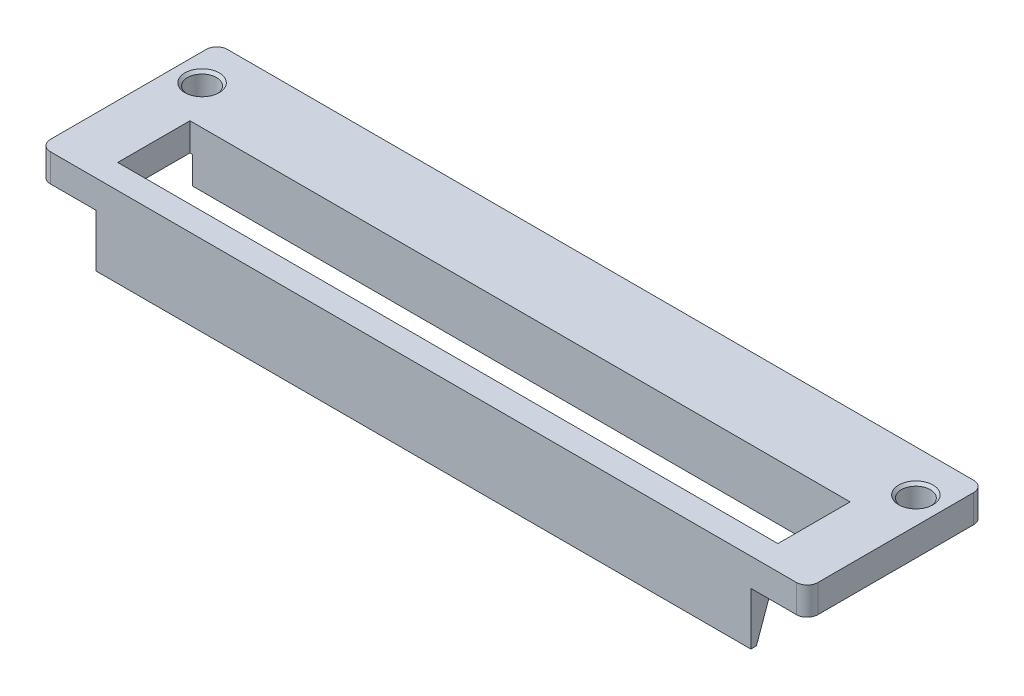
ISO-10303-21;
HEADER;
FILE_DESCRIPTION(('STEP AP214'),'2;1');
FILE_NAME('part.step','',(''),(''),'','','');
FILE_SCHEMA(('AUTOMOTIVE_DESIGN { 1 0 10303 214 1 1 1 1 }'));
ENDSEC;
DATA;
#1=APPLICATION_CONTEXT('core data for automotive mechanical design processes');
#2=APPLICATION_PROTOCOL_DEFINITION('international standard','automotive_design',2000,#1);
#3=PRODUCT_CONTEXT('',#1,'mechanical');
#4=PRODUCT('Part','Part','',(#3));
#5=PRODUCT_RELATED_PRODUCT_CATEGORY('part','',(#4));
#6=PRODUCT_DEFINITION_FORMATION('','',#4);
#7=PRODUCT_DEFINITION_CONTEXT('part definition',#1,'design');
#8=PRODUCT_DEFINITION('design','',#6,#7);
#9=PRODUCT_DEFINITION_SHAPE('','',#8);
#10=(LENGTH_UNIT() NAMED_UNIT(*) SI_UNIT(.MILLI.,.METRE.));
#11=(NAMED_UNIT(*) PLANE_ANGLE_UNIT() SI_UNIT($,.RADIAN.));
#12=(NAMED_UNIT(*) SI_UNIT($,.STERADIAN.) SOLID_ANGLE_UNIT());
#13=UNCERTAINTY_MEASURE_WITH_UNIT(LENGTH_MEASURE(1.E-05),#10,'distance_accuracy_value','');
#14=(GEOMETRIC_REPRESENTATION_CONTEXT(3) GLOBAL_UNCERTAINTY_ASSIGNED_CONTEXT((#13)) GLOBAL_UNIT_ASSIGNED_CONTEXT((#10,
#11,#12)) REPRESENTATION_CONTEXT('',''));
#15=CARTESIAN_POINT('',(0.,0.,0.));
#16=DIRECTION('',(0.,0.,1.));
#17=DIRECTION('',(1.,0.,0.));
#18=AXIS2_PLACEMENT_3D('',#15,#16,#17);
#19=CARTESIAN_POINT('',(0.,-2.6,0.));
#20=DIRECTION('',(0.,1.,0.));
#21=DIRECTION('',(0.,0.,1.));
#22=AXIS2_PLACEMENT_3D('',#19,#20,#21);
#23=PLANE('',#22);
#24=DIRECTION('',(1.,0.,0.));
#25=VECTOR('',#24,1.);
#26=CARTESIAN_POINT('',(0.,-2.6,16.5));
#27=LINE('',#26,#25);
#28=CARTESIAN_POINT('',(1.,-2.6,16.5));
#29=VERTEX_POINT('',#28);
#30=CARTESIAN_POINT('',(5.25,-2.6,16.5));
#31=VERTEX_POINT('',#30);
#32=EDGE_CURVE('E290',#29,#31,#27,.T.);
#33=ORIENTED_EDGE('',*,*,#32,.F.);
#34=CARTESIAN_POINT('',(1.,-2.6,15.5));
#35=DIRECTION('',(0.,1.,0.));
#36=DIRECTION('',(0.,0.,1.));
#37=AXIS2_PLACEMENT_3D('',#34,#35,#36);
#38=CIRCLE('',#37,1.);
#39=CARTESIAN_POINT('',(0.,-2.6,15.5));
#40=VERTEX_POINT('',#39);
#41=EDGE_CURVE('E58',#29,#40,#38,.F.);
#42=ORIENTED_EDGE('',*,*,#41,.T.);
#43=DIRECTION('',(0.,0.,1.));
#44=VECTOR('',#43,1.);
#45=CARTESIAN_POINT('',(0.,-2.6,7.5));
#46=LINE('',#45,#44);
#47=CARTESIAN_POINT('',(0.,-2.6,1.));
#48=VERTEX_POINT('',#47);
#49=EDGE_CURVE('E286',#48,#40,#46,.T.);
#50=ORIENTED_EDGE('',*,*,#49,.F.);
#51=CARTESIAN_POINT('',(1.,-2.6,1.));
#52=DIRECTION('',(0.,1.,0.));
#53=DIRECTION('',(0.,0.,1.));
#54=AXIS2_PLACEMENT_3D('',#51,#52,#53);
#55=CIRCLE('',#54,1.);
#56=CARTESIAN_POINT('',(1.,-2.6,0.));
#57=VERTEX_POINT('',#56);
#58=EDGE_CURVE('E199',#48,#57,#55,.F.);
#59=ORIENTED_EDGE('',*,*,#58,.T.);
#60=DIRECTION('',(1.,0.,0.));
#61=VECTOR('',#60,1.);
#62=CARTESIAN_POINT('',(0.,-2.6,0.));
#63=LINE('',#62,#61);
#64=CARTESIAN_POINT('',(5.25,-2.6,0.));
#65=VERTEX_POINT('',#64);
#66=EDGE_CURVE('E193',#57,#65,#63,.T.);
#67=ORIENTED_EDGE('',*,*,#66,.T.);
#68=DIRECTION('',(0.,0.,-1.));
#69=VECTOR('',#68,1.);
#70=CARTESIAN_POINT('',(5.25,-2.6,16.5));
#71=LINE('',#70,#69);
#72=CARTESIAN_POINT('',(5.25,-2.6,7.5));
#73=VERTEX_POINT('',#72);
#74=EDGE_CURVE('E196',#73,#65,#71,.T.);
#75=ORIENTED_EDGE('',*,*,#74,.F.);
#76=DIRECTION('',(1.,0.,0.));
#77=VECTOR('',#76,1.);
#78=CARTESIAN_POINT('',(71.5,-2.6,7.5));
#79=LINE('',#78,#77);
#80=CARTESIAN_POINT('',(5.,-2.6,7.5));
#81=VERTEX_POINT('',#80);
#82=EDGE_CURVE('E222',#81,#73,#79,.T.);
#83=ORIENTED_EDGE('',*,*,#82,.F.);
#84=DIRECTION('',(0.,0.,-1.));
#85=VECTOR('',#84,1.);
#86=CARTESIAN_POINT('',(5.,-2.6,14.23));
#87=LINE('',#86,#85);
#88=CARTESIAN_POINT('',(5.,-2.6,14.23));
#89=VERTEX_POINT('',#88);
#90=EDGE_CURVE('E302',#89,#81,#87,.T.);
#91=ORIENTED_EDGE('',*,*,#90,.F.);
#92=DIRECTION('',(-1.,0.,0.));
#93=VECTOR('',#92,1.);
#94=CARTESIAN_POINT('',(66.5,-2.6,14.23));
#95=LINE('',#94,#93);
#96=CARTESIAN_POINT('',(5.25,-2.6,14.23));
#97=VERTEX_POINT('',#96);
#98=EDGE_CURVE('E298',#97,#89,#95,.T.);
#99=ORIENTED_EDGE('',*,*,#98,.F.);
#100=DIRECTION('',(0.,0.,-1.));
#101=VECTOR('',#100,1.);
#102=CARTESIAN_POINT('',(5.25,-2.6,14.23));
#103=LINE('',#102,#101);
#104=EDGE_CURVE('E258',#31,#97,#103,.T.);
#105=ORIENTED_EDGE('',*,*,#104,.F.);
#106=EDGE_LOOP('',(#33,#42,#50,#59,#67,#75,#83,#91,#99,#105));
#107=FACE_BOUND('',#106,.T.);
#108=CARTESIAN_POINT('',(2.5,-2.6,3.875));
#109=DIRECTION('',(0.,1.,0.));
#110=DIRECTION('',(0.,0.,1.));
#111=AXIS2_PLACEMENT_3D('',#108,#109,#110);
#112=CIRCLE('',#111,1.35);
#113=CARTESIAN_POINT('',(2.5,-2.6,5.225));
#114=VERTEX_POINT('',#113);
#115=EDGE_CURVE('E234',#114,#114,#112,.F.);
#116=ORIENTED_EDGE('',*,*,#115,.F.);
#117=EDGE_LOOP('',(#116));
#118=FACE_BOUND('',#117,.T.);
#119=ADVANCED_FACE('F42',(#107,#118),#23,.F.);
#120=CARTESIAN_POINT('',(71.5,-5.81,0.));
#121=DIRECTION('',(0.,0.,1.));
#122=DIRECTION('',(1.,0.,0.));
#123=AXIS2_PLACEMENT_3D('',#120,#121,#122);
#124=PLANE('',#123);
#125=DIRECTION('',(-1.,0.,0.));
#126=VECTOR('',#125,1.);
#127=CARTESIAN_POINT('',(71.5,0.,0.));
#128=LINE('',#127,#126);
#129=CARTESIAN_POINT('',(70.5,0.,0.));
#130=VERTEX_POINT('',#129);
#131=CARTESIAN_POINT('',(1.,0.,0.));
#132=VERTEX_POINT('',#131);
#133=EDGE_CURVE('E343',#130,#132,#128,.T.);
#134=ORIENTED_EDGE('',*,*,#133,.F.);
#135=DIRECTION('',(0.,1.,0.));
#136=VECTOR('',#135,1.);
#137=CARTESIAN_POINT('',(70.5,-2.6,0.));
#138=LINE('',#137,#136);
#139=CARTESIAN_POINT('',(70.5,-2.6,0.));
#140=VERTEX_POINT('',#139);
#141=EDGE_CURVE('E361',#130,#140,#138,.F.);
#142=ORIENTED_EDGE('',*,*,#141,.T.);
#143=DIRECTION('',(1.,0.,0.));
#144=VECTOR('',#143,1.);
#145=CARTESIAN_POINT('',(71.5,-2.6,0.));
#146=LINE('',#145,#144);
#147=CARTESIAN_POINT('',(66.25,-2.6,0.));
#148=VERTEX_POINT('',#147);
#149=EDGE_CURVE('E227',#148,#140,#146,.T.);
#150=ORIENTED_EDGE('',*,*,#149,.F.);
#151=DIRECTION('',(0.,1.,0.));
#152=VECTOR('',#151,1.);
#153=CARTESIAN_POINT('',(66.25,-2.6,0.));
#154=LINE('',#153,#152);
#155=CARTESIAN_POINT('',(66.25,-5.81,0.));
#156=VERTEX_POINT('',#155);
#157=EDGE_CURVE('E224',#156,#148,#154,.T.);
#158=ORIENTED_EDGE('',*,*,#157,.F.);
#159=DIRECTION('',(-1.,0.,0.));
#160=VECTOR('',#159,1.);
#161=CARTESIAN_POINT('',(71.5,-5.81,0.));
#162=LINE('',#161,#160);
#163=CARTESIAN_POINT('',(5.25,-5.81,0.));
#164=VERTEX_POINT('',#163);
#165=EDGE_CURVE('E219',#156,#164,#162,.T.);
#166=ORIENTED_EDGE('',*,*,#165,.T.);
#167=DIRECTION('',(0.,-1.,0.));
#168=VECTOR('',#167,1.);
#169=CARTESIAN_POINT('',(5.25,-2.6,0.));
#170=LINE('',#169,#168);
#171=EDGE_CURVE('E204',#65,#164,#170,.T.);
#172=ORIENTED_EDGE('',*,*,#171,.F.);
#173=ORIENTED_EDGE('',*,*,#66,.F.);
#174=DIRECTION('',(0.,1.,0.));
#175=VECTOR('',#174,1.);
#176=CARTESIAN_POINT('',(1.,-5.81,0.));
#177=LINE('',#176,#175);
#178=EDGE_CURVE('E359',#57,#132,#177,.T.);
#179=ORIENTED_EDGE('',*,*,#178,.T.);
#180=EDGE_LOOP('',(#134,#142,#150,#158,#166,#172,#173,#179));
#181=FACE_BOUND('',#180,.T.);
#182=ADVANCED_FACE('F216',(#181),#124,.F.);
#183=CARTESIAN_POINT('',(71.5,0.,0.));
#184=DIRECTION('',(0.,-1.,0.));
#185=DIRECTION('',(0.,0.,-1.));
#186=AXIS2_PLACEMENT_3D('',#183,#184,#185);
#187=PLANE('',#186);
#188=CARTESIAN_POINT('',(2.5,0.,3.875));
#189=DIRECTION('',(0.,-1.,0.));
#190=DIRECTION('',(0.,0.,-1.));
#191=AXIS2_PLACEMENT_3D('',#188,#189,#190);
#192=CIRCLE('',#191,1.6);
#193=CARTESIAN_POINT('',(2.5,0.,2.275));
#194=VERTEX_POINT('',#193);
#195=EDGE_CURVE('E51',#194,#194,#192,.T.);
#196=ORIENTED_EDGE('',*,*,#195,.T.);
#197=EDGE_LOOP('',(#196));
#198=FACE_BOUND('',#197,.T.);
#199=CARTESIAN_POINT('',(69.,0.,3.875));
#200=DIRECTION('',(0.,-1.,0.));
#201=DIRECTION('',(0.,0.,-1.));
#202=AXIS2_PLACEMENT_3D('',#199,#200,#201);
#203=CIRCLE('',#202,1.60000000000002);
#204=CARTESIAN_POINT('',(69.,0.,2.27499999999998));
#205=VERTEX_POINT('',#204);
#206=EDGE_CURVE('E381',#205,#205,#203,.T.);
#207=ORIENTED_EDGE('',*,*,#206,.T.);
#208=EDGE_LOOP('',(#207));
#209=FACE_BOUND('',#208,.T.);
#210=DIRECTION('',(0.,0.,1.));
#211=VECTOR('',#210,1.);
#212=CARTESIAN_POINT('',(71.5,0.,0.));
#213=LINE('',#212,#211);
#214=CARTESIAN_POINT('',(71.5,0.,1.));
#215=VERTEX_POINT('',#214);
#216=CARTESIAN_POINT('',(71.5,0.,15.5));
#217=VERTEX_POINT('',#216);
#218=EDGE_CURVE('E326',#215,#217,#213,.T.);
#219=ORIENTED_EDGE('',*,*,#218,.F.);
#220=CARTESIAN_POINT('',(70.5,0.,1.));
#221=DIRECTION('',(0.,-1.,0.));
#222=DIRECTION('',(0.,0.,-1.));
#223=AXIS2_PLACEMENT_3D('',#220,#221,#222);
#224=CIRCLE('',#223,1.);
#225=EDGE_CURVE('E357',#215,#130,#224,.F.);
#226=ORIENTED_EDGE('',*,*,#225,.T.);
#227=ORIENTED_EDGE('',*,*,#133,.T.);
#228=CARTESIAN_POINT('',(1.,0.,1.));
#229=DIRECTION('',(0.,-1.,0.));
#230=DIRECTION('',(0.,0.,-1.));
#231=AXIS2_PLACEMENT_3D('',#228,#229,#230);
#232=CIRCLE('',#231,1.);
#233=CARTESIAN_POINT('',(0.,0.,1.));
#234=VERTEX_POINT('',#233);
#235=EDGE_CURVE('E351',#132,#234,#232,.F.);
#236=ORIENTED_EDGE('',*,*,#235,.T.);
#237=DIRECTION('',(0.,0.,1.));
#238=VECTOR('',#237,1.);
#239=CARTESIAN_POINT('',(0.,0.,0.));
#240=LINE('',#239,#238);
#241=CARTESIAN_POINT('',(0.,0.,15.5));
#242=VERTEX_POINT('',#241);
#243=EDGE_CURVE('E319',#234,#242,#240,.T.);
#244=ORIENTED_EDGE('',*,*,#243,.T.);
#245=CARTESIAN_POINT('',(1.,0.,15.5));
#246=DIRECTION('',(0.,-1.,0.));
#247=DIRECTION('',(0.,0.,-1.));
#248=AXIS2_PLACEMENT_3D('',#245,#246,#247);
#249=CIRCLE('',#248,1.);
#250=CARTESIAN_POINT('',(1.,0.,16.5));
#251=VERTEX_POINT('',#250);
#252=EDGE_CURVE('E353',#242,#251,#249,.F.);
#253=ORIENTED_EDGE('',*,*,#252,.T.);
#254=DIRECTION('',(1.,0.,0.));
#255=VECTOR('',#254,1.);
#256=CARTESIAN_POINT('',(0.,0.,16.5));
#257=LINE('',#256,#255);
#258=CARTESIAN_POINT('',(70.5,0.,16.5));
#259=VERTEX_POINT('',#258);
#260=EDGE_CURVE('E281',#251,#259,#257,.T.);
#261=ORIENTED_EDGE('',*,*,#260,.T.);
#262=CARTESIAN_POINT('',(70.5,0.,15.5));
#263=DIRECTION('',(0.,-1.,0.));
#264=DIRECTION('',(0.,0.,-1.));
#265=AXIS2_PLACEMENT_3D('',#262,#263,#264);
#266=CIRCLE('',#265,1.);
#267=EDGE_CURVE('E355',#259,#217,#266,.F.);
#268=ORIENTED_EDGE('',*,*,#267,.T.);
#269=EDGE_LOOP('',(#219,#226,#227,#236,#244,#253,#261,#268));
#270=FACE_BOUND('',#269,.T.);
#271=DIRECTION('',(0.,0.,-1.));
#272=VECTOR('',#271,1.);
#273=CARTESIAN_POINT('',(5.,0.,14.23));
#274=LINE('',#273,#272);
#275=CARTESIAN_POINT('',(5.,0.,14.23));
#276=VERTEX_POINT('',#275);
#277=CARTESIAN_POINT('',(5.,0.,7.5));
#278=VERTEX_POINT('',#277);
#279=EDGE_CURVE('E289',#276,#278,#274,.T.);
#280=ORIENTED_EDGE('',*,*,#279,.T.);
#281=DIRECTION('',(-1.,0.,0.));
#282=VECTOR('',#281,1.);
#283=CARTESIAN_POINT('',(71.5,0.,7.5));
#284=LINE('',#283,#282);
#285=CARTESIAN_POINT('',(66.5,0.,7.5));
#286=VERTEX_POINT('',#285);
#287=EDGE_CURVE('E341',#286,#278,#284,.T.);
#288=ORIENTED_EDGE('',*,*,#287,.F.);
#289=DIRECTION('',(0.,0.,1.));
#290=VECTOR('',#289,1.);
#291=CARTESIAN_POINT('',(66.5,0.,7.5));
#292=LINE('',#291,#290);
#293=CARTESIAN_POINT('',(66.5,0.,14.23));
#294=VERTEX_POINT('',#293);
#295=EDGE_CURVE('E308',#286,#294,#292,.T.);
#296=ORIENTED_EDGE('',*,*,#295,.T.);
#297=DIRECTION('',(-1.,0.,0.));
#298=VECTOR('',#297,1.);
#299=CARTESIAN_POINT('',(66.5,0.,14.23));
#300=LINE('',#299,#298);
#301=EDGE_CURVE('E311',#294,#276,#300,.T.);
#302=ORIENTED_EDGE('',*,*,#301,.T.);
#303=EDGE_LOOP('',(#280,#288,#296,#302));
#304=FACE_BOUND('',#303,.T.);
#305=ADVANCED_FACE('F386',(#198,#209,#270,#304),#187,.F.);
#306=CARTESIAN_POINT('',(71.5,0.,7.5));
#307=DIRECTION('',(0.,0.,-1.));
#308=DIRECTION('',(0.,1.,0.));
#309=AXIS2_PLACEMENT_3D('',#306,#307,#308);
#310=PLANE('',#309);
#311=ORIENTED_EDGE('',*,*,#82,.T.);
#312=DIRECTION('',(0.,-1.,0.));
#313=VECTOR('',#312,1.);
#314=CARTESIAN_POINT('',(5.25,0.,7.5));
#315=LINE('',#314,#313);
#316=CARTESIAN_POINT('',(5.25,-5.15,7.5));
#317=VERTEX_POINT('',#316);
#318=EDGE_CURVE('E211',#73,#317,#315,.T.);
#319=ORIENTED_EDGE('',*,*,#318,.T.);
#320=DIRECTION('',(-1.,0.,0.));
#321=VECTOR('',#320,1.);
#322=CARTESIAN_POINT('',(71.5,-5.15,7.5));
#323=LINE('',#322,#321);
#324=CARTESIAN_POINT('',(66.25,-5.15,7.5));
#325=VERTEX_POINT('',#324);
#326=EDGE_CURVE('E338',#325,#317,#323,.T.);
#327=ORIENTED_EDGE('',*,*,#326,.F.);
#328=DIRECTION('',(0.,1.,0.));
#329=VECTOR('',#328,1.);
#330=CARTESIAN_POINT('',(66.25,0.,7.5));
#331=LINE('',#330,#329);
#332=CARTESIAN_POINT('',(66.25,-2.6,7.5));
#333=VERTEX_POINT('',#332);
#334=EDGE_CURVE('E248',#325,#333,#331,.T.);
#335=ORIENTED_EDGE('',*,*,#334,.T.);
#336=DIRECTION('',(1.,0.,0.));
#337=VECTOR('',#336,1.);
#338=CARTESIAN_POINT('',(71.5,-2.6,7.5));
#339=LINE('',#338,#337);
#340=CARTESIAN_POINT('',(66.5,-2.6,7.5));
#341=VERTEX_POINT('',#340);
#342=EDGE_CURVE('E238',#333,#341,#339,.T.);
#343=ORIENTED_EDGE('',*,*,#342,.T.);
#344=DIRECTION('',(0.,1.,0.));
#345=VECTOR('',#344,1.);
#346=CARTESIAN_POINT('',(66.5,-2.6,7.5));
#347=LINE('',#346,#345);
#348=EDGE_CURVE('E305',#341,#286,#347,.T.);
#349=ORIENTED_EDGE('',*,*,#348,.T.);
#350=ORIENTED_EDGE('',*,*,#287,.T.);
#351=DIRECTION('',(0.,1.,0.));
#352=VECTOR('',#351,1.);
#353=CARTESIAN_POINT('',(5.,-2.6,7.5));
#354=LINE('',#353,#352);
#355=EDGE_CURVE('E316',#81,#278,#354,.T.);
#356=ORIENTED_EDGE('',*,*,#355,.F.);
#357=EDGE_LOOP('',(#311,#319,#327,#335,#343,#349,#350,#356));
#358=FACE_BOUND('',#357,.T.);
#359=ADVANCED_FACE('F454',(#358),#310,.F.);
#360=CARTESIAN_POINT('',(71.5,-5.15,7.5));
#361=DIRECTION('',(0.,1.,0.));
#362=DIRECTION('',(0.,0.,1.));
#363=AXIS2_PLACEMENT_3D('',#360,#361,#362);
#364=PLANE('',#363);
#365=ORIENTED_EDGE('',*,*,#326,.T.);
#366=DIRECTION('',(0.,0.,-1.));
#367=VECTOR('',#366,1.);
#368=CARTESIAN_POINT('',(5.25,-5.15,7.5));
#369=LINE('',#368,#367);
#370=CARTESIAN_POINT('',(5.25,-5.15,6.25));
#371=VERTEX_POINT('',#370);
#372=EDGE_CURVE('E254',#317,#371,#369,.T.);
#373=ORIENTED_EDGE('',*,*,#372,.T.);
#374=DIRECTION('',(-1.,0.,0.));
#375=VECTOR('',#374,1.);
#376=CARTESIAN_POINT('',(71.5,-5.15,6.25));
#377=LINE('',#376,#375);
#378=CARTESIAN_POINT('',(66.25,-5.15,6.25));
#379=VERTEX_POINT('',#378);
#380=EDGE_CURVE('E335',#379,#371,#377,.T.);
#381=ORIENTED_EDGE('',*,*,#380,.F.);
#382=DIRECTION('',(0.,0.,1.));
#383=VECTOR('',#382,1.);
#384=CARTESIAN_POINT('',(66.25,-5.15,7.5));
#385=LINE('',#384,#383);
#386=EDGE_CURVE('E245',#379,#325,#385,.T.);
#387=ORIENTED_EDGE('',*,*,#386,.T.);
#388=EDGE_LOOP('',(#365,#373,#381,#387));
#389=FACE_BOUND('',#388,.T.);
#390=ADVANCED_FACE('F450',(#389),#364,.F.);
#391=CARTESIAN_POINT('',(71.5,-5.15,6.25));
#392=DIRECTION('',(0.,0.,-1.));
#393=DIRECTION('',(-1.,0.,0.));
#394=AXIS2_PLACEMENT_3D('',#391,#392,#393);
#395=PLANE('',#394);
#396=ORIENTED_EDGE('',*,*,#380,.T.);
#397=DIRECTION('',(0.,-1.,0.));
#398=VECTOR('',#397,1.);
#399=CARTESIAN_POINT('',(5.25,-5.15,6.25));
#400=LINE('',#399,#398);
#401=CARTESIAN_POINT('',(5.25,-5.81,6.25));
#402=VERTEX_POINT('',#401);
#403=EDGE_CURVE('E251',#371,#402,#400,.T.);
#404=ORIENTED_EDGE('',*,*,#403,.T.);
#405=DIRECTION('',(-1.,0.,0.));
#406=VECTOR('',#405,1.);
#407=CARTESIAN_POINT('',(71.5,-5.81,6.25));
#408=LINE('',#407,#406);
#409=CARTESIAN_POINT('',(66.25,-5.81,6.25));
#410=VERTEX_POINT('',#409);
#411=EDGE_CURVE('E332',#410,#402,#408,.T.);
#412=ORIENTED_EDGE('',*,*,#411,.F.);
#413=DIRECTION('',(0.,1.,0.));
#414=VECTOR('',#413,1.);
#415=CARTESIAN_POINT('',(66.25,-5.15,6.25));
#416=LINE('',#415,#414);
#417=EDGE_CURVE('E240',#410,#379,#416,.T.);
#418=ORIENTED_EDGE('',*,*,#417,.T.);
#419=EDGE_LOOP('',(#396,#404,#412,#418));
#420=FACE_BOUND('',#419,.T.);
#421=ADVANCED_FACE('F446',(#420),#395,.F.);
#422=CARTESIAN_POINT('',(71.5,-5.81,6.25));
#423=DIRECTION('',(0.,1.,0.));
#424=DIRECTION('',(0.,0.,1.));
#425=AXIS2_PLACEMENT_3D('',#422,#423,#424);
#426=PLANE('',#425);
#427=ORIENTED_EDGE('',*,*,#411,.T.);
#428=DIRECTION('',(0.,0.,-1.));
#429=VECTOR('',#428,1.);
#430=CARTESIAN_POINT('',(5.25,-5.81,16.5));
#431=LINE('',#430,#429);
#432=EDGE_CURVE('E212',#402,#164,#431,.T.);
#433=ORIENTED_EDGE('',*,*,#432,.T.);
#434=ORIENTED_EDGE('',*,*,#165,.F.);
#435=DIRECTION('',(0.,0.,-1.));
#436=VECTOR('',#435,1.);
#437=CARTESIAN_POINT('',(66.25,-5.81,16.5));
#438=LINE('',#437,#436);
#439=EDGE_CURVE('E230',#410,#156,#438,.T.);
#440=ORIENTED_EDGE('',*,*,#439,.F.);
#441=EDGE_LOOP('',(#427,#433,#434,#440));
#442=FACE_BOUND('',#441,.T.);
#443=ADVANCED_FACE('F441',(#442),#426,.F.);
#444=CARTESIAN_POINT('',(71.5,0.,0.));
#445=DIRECTION('',(1.,0.,0.));
#446=DIRECTION('',(0.,0.,-1.));
#447=AXIS2_PLACEMENT_3D('',#444,#445,#446);
#448=PLANE('',#447);
#449=DIRECTION('',(0.,0.,-1.));
#450=VECTOR('',#449,1.);
#451=CARTESIAN_POINT('',(71.5,-2.6,16.5));
#452=LINE('',#451,#450);
#453=CARTESIAN_POINT('',(71.5,-2.6,15.5));
#454=VERTEX_POINT('',#453);
#455=CARTESIAN_POINT('',(71.5,-2.6,1.));
#456=VERTEX_POINT('',#455);
#457=EDGE_CURVE('E292',#454,#456,#452,.T.);
#458=ORIENTED_EDGE('',*,*,#457,.T.);
#459=DIRECTION('',(0.,1.,0.));
#460=VECTOR('',#459,1.);
#461=CARTESIAN_POINT('',(71.5,0.,1.));
#462=LINE('',#461,#460);
#463=EDGE_CURVE('E348',#456,#215,#462,.T.);
#464=ORIENTED_EDGE('',*,*,#463,.T.);
#465=ORIENTED_EDGE('',*,*,#218,.T.);
#466=DIRECTION('',(0.,1.,0.));
#467=VECTOR('',#466,1.);
#468=CARTESIAN_POINT('',(71.5,0.,15.5));
#469=LINE('',#468,#467);
#470=EDGE_CURVE('E346',#217,#454,#469,.F.);
#471=ORIENTED_EDGE('',*,*,#470,.T.);
#472=EDGE_LOOP('',(#458,#464,#465,#471));
#473=FACE_BOUND('',#472,.T.);
#474=ADVANCED_FACE('F437',(#473),#448,.T.);
#475=CARTESIAN_POINT('',(0.,0.,0.));
#476=DIRECTION('',(1.,0.,0.));
#477=DIRECTION('',(0.,0.,-1.));
#478=AXIS2_PLACEMENT_3D('',#475,#476,#477);
#479=PLANE('',#478);
#480=ORIENTED_EDGE('',*,*,#49,.T.);
#481=DIRECTION('',(0.,1.,0.));
#482=VECTOR('',#481,1.);
#483=CARTESIAN_POINT('',(0.,0.,15.5));
#484=LINE('',#483,#482);
#485=EDGE_CURVE('E373',#40,#242,#484,.T.);
#486=ORIENTED_EDGE('',*,*,#485,.T.);
#487=ORIENTED_EDGE('',*,*,#243,.F.);
#488=DIRECTION('',(0.,1.,0.));
#489=VECTOR('',#488,1.);
#490=CARTESIAN_POINT('',(0.,0.,1.));
#491=LINE('',#490,#489);
#492=EDGE_CURVE('E65',#234,#48,#491,.F.);
#493=ORIENTED_EDGE('',*,*,#492,.T.);
#494=EDGE_LOOP('',(#480,#486,#487,#493));
#495=FACE_BOUND('',#494,.T.);
#496=ADVANCED_FACE('F431',(#495),#479,.F.);
#497=CARTESIAN_POINT('',(69.,-5.81,3.875));
#498=DIRECTION('',(0.,1.,0.));
#499=DIRECTION('',(0.,0.,1.));
#500=AXIS2_PLACEMENT_3D('',#497,#498,#499);
#501=CYLINDRICAL_SURFACE('',#500,1.35000000000001);
#502=CARTESIAN_POINT('',(69.,-0.250000000000017,3.875));
#503=DIRECTION('',(0.,-1.,0.));
#504=DIRECTION('',(0.,0.,-1.));
#505=AXIS2_PLACEMENT_3D('',#502,#503,#504);
#506=CIRCLE('',#505,1.35000000000001);
#507=CARTESIAN_POINT('',(69.,-0.250000000000017,2.52499999999999));
#508=VERTEX_POINT('',#507);
#509=EDGE_CURVE('E11',#508,#508,#506,.F.);
#510=ORIENTED_EDGE('',*,*,#509,.T.);
#511=EDGE_LOOP('',(#510));
#512=FACE_BOUND('',#511,.T.);
#513=CARTESIAN_POINT('',(69.,-2.6,3.875));
#514=DIRECTION('',(0.,1.,0.));
#515=DIRECTION('',(0.,0.,1.));
#516=AXIS2_PLACEMENT_3D('',#513,#514,#515);
#517=CIRCLE('',#516,1.35000000000001);
#518=CARTESIAN_POINT('',(69.,-2.6,5.22500000000001));
#519=VERTEX_POINT('',#518);
#520=EDGE_CURVE('E237',#519,#519,#517,.F.);
#521=ORIENTED_EDGE('',*,*,#520,.T.);
#522=EDGE_LOOP('',(#521));
#523=FACE_BOUND('',#522,.T.);
#524=ADVANCED_FACE('F399',(#512,#523),#501,.F.);
#525=CARTESIAN_POINT('',(2.5,-5.81,3.875));
#526=DIRECTION('',(0.,1.,0.));
#527=DIRECTION('',(0.,0.,1.));
#528=AXIS2_PLACEMENT_3D('',#525,#526,#527);
#529=CYLINDRICAL_SURFACE('',#528,1.35);
#530=CARTESIAN_POINT('',(2.5,-0.249999999999995,3.875));
#531=DIRECTION('',(0.,-1.,0.));
#532=DIRECTION('',(0.,0.,-1.));
#533=AXIS2_PLACEMENT_3D('',#530,#531,#532);
#534=CIRCLE('',#533,1.35);
#535=CARTESIAN_POINT('',(2.5,-0.249999999999995,2.525));
#536=VERTEX_POINT('',#535);
#537=EDGE_CURVE('E378',#536,#536,#534,.F.);
#538=ORIENTED_EDGE('',*,*,#537,.T.);
#539=EDGE_LOOP('',(#538));
#540=FACE_BOUND('',#539,.T.);
#541=ORIENTED_EDGE('',*,*,#115,.T.);
#542=EDGE_LOOP('',(#541));
#543=FACE_BOUND('',#542,.T.);
#544=ADVANCED_FACE('F395',(#540,#543),#529,.F.);
#545=CARTESIAN_POINT('',(5.,-2.6,14.23));
#546=DIRECTION('',(1.,0.,0.));
#547=DIRECTION('',(0.,0.,-1.));
#548=AXIS2_PLACEMENT_3D('',#545,#546,#547);
#549=PLANE('',#548);
#550=ORIENTED_EDGE('',*,*,#279,.F.);
#551=DIRECTION('',(0.,1.,0.));
#552=VECTOR('',#551,1.);
#553=CARTESIAN_POINT('',(5.,-2.6,14.23));
#554=LINE('',#553,#552);
#555=EDGE_CURVE('E320',#89,#276,#554,.T.);
#556=ORIENTED_EDGE('',*,*,#555,.F.);
#557=ORIENTED_EDGE('',*,*,#90,.T.);
#558=ORIENTED_EDGE('',*,*,#355,.T.);
#559=EDGE_LOOP('',(#550,#556,#557,#558));
#560=FACE_BOUND('',#559,.T.);
#561=ADVANCED_FACE('F398',(#560),#549,.T.);
#562=CARTESIAN_POINT('',(66.5,-2.6,14.23));
#563=DIRECTION('',(0.,0.,-1.));
#564=DIRECTION('',(-1.,0.,0.));
#565=AXIS2_PLACEMENT_3D('',#562,#563,#564);
#566=PLANE('',#565);
#567=ORIENTED_EDGE('',*,*,#301,.F.);
#568=DIRECTION('',(0.,1.,0.));
#569=VECTOR('',#568,1.);
#570=CARTESIAN_POINT('',(66.5,-2.6,14.23));
#571=LINE('',#570,#569);
#572=CARTESIAN_POINT('',(66.5,-2.6,14.23));
#573=VERTEX_POINT('',#572);
#574=EDGE_CURVE('E322',#573,#294,#571,.T.);
#575=ORIENTED_EDGE('',*,*,#574,.F.);
#576=CARTESIAN_POINT('',(66.25,-2.6,14.23));
#577=VERTEX_POINT('',#576);
#578=EDGE_CURVE('E299',#573,#577,#95,.T.);
#579=ORIENTED_EDGE('',*,*,#578,.T.);
#580=DIRECTION('',(-1.,0.,0.));
#581=VECTOR('',#580,1.);
#582=CARTESIAN_POINT('',(66.25,-2.6,14.23));
#583=LINE('',#582,#581);
#584=EDGE_CURVE('E269',#577,#97,#583,.T.);
#585=ORIENTED_EDGE('',*,*,#584,.T.);
#586=ORIENTED_EDGE('',*,*,#98,.T.);
#587=ORIENTED_EDGE('',*,*,#555,.T.);
#588=EDGE_LOOP('',(#567,#575,#579,#585,#586,#587));
#589=FACE_BOUND('',#588,.T.);
#590=ADVANCED_FACE('F517',(#589),#566,.T.);
#591=CARTESIAN_POINT('',(66.5,-2.6,7.5));
#592=DIRECTION('',(-1.,0.,0.));
#593=DIRECTION('',(0.,0.,1.));
#594=AXIS2_PLACEMENT_3D('',#591,#592,#593);
#595=PLANE('',#594);
#596=ORIENTED_EDGE('',*,*,#295,.F.);
#597=ORIENTED_EDGE('',*,*,#348,.F.);
#598=DIRECTION('',(0.,0.,1.));
#599=VECTOR('',#598,1.);
#600=CARTESIAN_POINT('',(66.5,-2.6,7.5));
#601=LINE('',#600,#599);
#602=EDGE_CURVE('E295',#341,#573,#601,.T.);
#603=ORIENTED_EDGE('',*,*,#602,.T.);
#604=ORIENTED_EDGE('',*,*,#574,.T.);
#605=EDGE_LOOP('',(#596,#597,#603,#604));
#606=FACE_BOUND('',#605,.T.);
#607=ADVANCED_FACE('F422',(#606),#595,.T.);
#608=CARTESIAN_POINT('',(0.,-2.6,16.5));
#609=DIRECTION('',(0.,0.,1.));
#610=DIRECTION('',(1.,0.,0.));
#611=AXIS2_PLACEMENT_3D('',#608,#609,#610);
#612=PLANE('',#611);
#613=CARTESIAN_POINT('',(66.25,-2.6,16.5));
#614=VERTEX_POINT('',#613);
#615=CARTESIAN_POINT('',(70.5,-2.6,16.5));
#616=VERTEX_POINT('',#615);
#617=EDGE_CURVE('E288',#614,#616,#27,.T.);
#618=ORIENTED_EDGE('',*,*,#617,.T.);
#619=DIRECTION('',(0.,1.,0.));
#620=VECTOR('',#619,1.);
#621=CARTESIAN_POINT('',(70.5,-2.6,16.5));
#622=LINE('',#621,#620);
#623=EDGE_CURVE('E369',#616,#259,#622,.T.);
#624=ORIENTED_EDGE('',*,*,#623,.T.);
#625=ORIENTED_EDGE('',*,*,#260,.F.);
#626=DIRECTION('',(0.,1.,0.));
#627=VECTOR('',#626,1.);
#628=CARTESIAN_POINT('',(1.,-2.6,16.5));
#629=LINE('',#628,#627);
#630=EDGE_CURVE('E367',#251,#29,#629,.F.);
#631=ORIENTED_EDGE('',*,*,#630,.T.);
#632=ORIENTED_EDGE('',*,*,#32,.T.);
#633=DIRECTION('',(0.,1.,0.));
#634=VECTOR('',#633,1.);
#635=CARTESIAN_POINT('',(5.25,-2.6,16.5));
#636=LINE('',#635,#634);
#637=CARTESIAN_POINT('',(5.25,-7.5,16.5));
#638=VERTEX_POINT('',#637);
#639=EDGE_CURVE('E262',#638,#31,#636,.T.);
#640=ORIENTED_EDGE('',*,*,#639,.F.);
#641=DIRECTION('',(-1.,0.,0.));
#642=VECTOR('',#641,1.);
#643=CARTESIAN_POINT('',(66.25,-7.5,16.5));
#644=LINE('',#643,#642);
#645=CARTESIAN_POINT('',(66.25,-7.5,16.5));
#646=VERTEX_POINT('',#645);
#647=EDGE_CURVE('E279',#646,#638,#644,.T.);
#648=ORIENTED_EDGE('',*,*,#647,.F.);
#649=DIRECTION('',(0.,1.,0.));
#650=VECTOR('',#649,1.);
#651=CARTESIAN_POINT('',(66.25,-2.6,16.5));
#652=LINE('',#651,#650);
#653=EDGE_CURVE('E267',#646,#614,#652,.T.);
#654=ORIENTED_EDGE('',*,*,#653,.T.);
#655=EDGE_LOOP('',(#618,#624,#625,#631,#632,#640,#648,#654));
#656=FACE_BOUND('',#655,.T.);
#657=ADVANCED_FACE('F413',(#656),#612,.T.);
#658=ORIENTED_EDGE('',*,*,#149,.T.);
#659=CARTESIAN_POINT('',(70.5,-2.6,1.));
#660=DIRECTION('',(0.,1.,0.));
#661=DIRECTION('',(0.,0.,1.));
#662=AXIS2_PLACEMENT_3D('',#659,#660,#661);
#663=CIRCLE('',#662,1.);
#664=EDGE_CURVE('E365',#140,#456,#663,.F.);
#665=ORIENTED_EDGE('',*,*,#664,.T.);
#666=ORIENTED_EDGE('',*,*,#457,.F.);
#667=CARTESIAN_POINT('',(70.5,-2.6,15.5));
#668=DIRECTION('',(0.,1.,0.));
#669=DIRECTION('',(0.,0.,1.));
#670=AXIS2_PLACEMENT_3D('',#667,#668,#669);
#671=CIRCLE('',#670,1.);
#672=EDGE_CURVE('E363',#454,#616,#671,.F.);
#673=ORIENTED_EDGE('',*,*,#672,.T.);
#674=ORIENTED_EDGE('',*,*,#617,.F.);
#675=DIRECTION('',(0.,0.,-1.));
#676=VECTOR('',#675,1.);
#677=CARTESIAN_POINT('',(66.25,-2.6,14.23));
#678=LINE('',#677,#676);
#679=EDGE_CURVE('E259',#614,#577,#678,.T.);
#680=ORIENTED_EDGE('',*,*,#679,.T.);
#681=ORIENTED_EDGE('',*,*,#578,.F.);
#682=ORIENTED_EDGE('',*,*,#602,.F.);
#683=ORIENTED_EDGE('',*,*,#342,.F.);
#684=DIRECTION('',(0.,0.,-1.));
#685=VECTOR('',#684,1.);
#686=CARTESIAN_POINT('',(66.25,-2.6,16.5));
#687=LINE('',#686,#685);
#688=EDGE_CURVE('E205',#333,#148,#687,.T.);
#689=ORIENTED_EDGE('',*,*,#688,.T.);
#690=EDGE_LOOP('',(#658,#665,#666,#673,#674,#680,#681,#682,#683,#689));
#691=FACE_BOUND('',#690,.T.);
#692=ORIENTED_EDGE('',*,*,#520,.F.);
#693=EDGE_LOOP('',(#692));
#694=FACE_BOUND('',#693,.T.);
#695=ADVANCED_FACE('F404',(#691,#694),#23,.F.);
#696=CARTESIAN_POINT('',(66.25,-7.5,15.98));
#697=DIRECTION('',(0.,-1.,0.));
#698=DIRECTION('',(0.,0.,-1.));
#699=AXIS2_PLACEMENT_3D('',#696,#697,#698);
#700=PLANE('',#699);
#701=DIRECTION('',(0.,0.,1.));
#702=VECTOR('',#701,1.);
#703=CARTESIAN_POINT('',(5.25,-7.5,15.98));
#704=LINE('',#703,#702);
#705=CARTESIAN_POINT('',(5.25,-7.5,15.98));
#706=VERTEX_POINT('',#705);
#707=EDGE_CURVE('E274',#706,#638,#704,.T.);
#708=ORIENTED_EDGE('',*,*,#707,.F.);
#709=DIRECTION('',(-1.,0.,0.));
#710=VECTOR('',#709,1.);
#711=CARTESIAN_POINT('',(66.25,-7.5,15.98));
#712=LINE('',#711,#710);
#713=CARTESIAN_POINT('',(66.25,-7.5,15.98));
#714=VERTEX_POINT('',#713);
#715=EDGE_CURVE('E282',#714,#706,#712,.T.);
#716=ORIENTED_EDGE('',*,*,#715,.F.);
#717=DIRECTION('',(0.,0.,1.));
#718=VECTOR('',#717,1.);
#719=CARTESIAN_POINT('',(66.25,-7.5,15.98));
#720=LINE('',#719,#718);
#721=EDGE_CURVE('E264',#714,#646,#720,.T.);
#722=ORIENTED_EDGE('',*,*,#721,.T.);
#723=ORIENTED_EDGE('',*,*,#647,.T.);
#724=EDGE_LOOP('',(#708,#716,#722,#723));
#725=FACE_BOUND('',#724,.T.);
#726=ADVANCED_FACE('F412',(#725),#700,.T.);
#727=CARTESIAN_POINT('',(66.25,-2.6,14.23));
#728=DIRECTION('',(0.,-0.336336396998156,-0.941741911594837));
#729=DIRECTION('',(0.,0.941741911594838,-0.336336396998156));
#730=AXIS2_PLACEMENT_3D('',#727,#728,#729);
#731=PLANE('',#730);
#732=DIRECTION('',(0.,-0.941741911594838,0.336336396998156));
#733=VECTOR('',#732,1.);
#734=CARTESIAN_POINT('',(5.25,-2.6,14.23));
#735=LINE('',#734,#733);
#736=EDGE_CURVE('E272',#97,#706,#735,.T.);
#737=ORIENTED_EDGE('',*,*,#736,.F.);
#738=ORIENTED_EDGE('',*,*,#584,.F.);
#739=DIRECTION('',(0.,-0.941741911594838,0.336336396998156));
#740=VECTOR('',#739,1.);
#741=CARTESIAN_POINT('',(66.25,-2.6,14.23));
#742=LINE('',#741,#740);
#743=EDGE_CURVE('E261',#577,#714,#742,.T.);
#744=ORIENTED_EDGE('',*,*,#743,.T.);
#745=ORIENTED_EDGE('',*,*,#715,.T.);
#746=EDGE_LOOP('',(#737,#738,#744,#745));
#747=FACE_BOUND('',#746,.T.);
#748=ADVANCED_FACE('F419',(#747),#731,.T.);
#749=CARTESIAN_POINT('',(66.25,0.,0.));
#750=DIRECTION('',(1.,0.,0.));
#751=DIRECTION('',(0.,0.,-1.));
#752=AXIS2_PLACEMENT_3D('',#749,#750,#751);
#753=PLANE('',#752);
#754=ORIENTED_EDGE('',*,*,#721,.F.);
#755=ORIENTED_EDGE('',*,*,#743,.F.);
#756=ORIENTED_EDGE('',*,*,#679,.F.);
#757=ORIENTED_EDGE('',*,*,#653,.F.);
#758=EDGE_LOOP('',(#754,#755,#756,#757));
#759=FACE_BOUND('',#758,.T.);
#760=ADVANCED_FACE('F511',(#759),#753,.T.);
#761=CARTESIAN_POINT('',(5.25,0.,0.));
#762=DIRECTION('',(1.,0.,0.));
#763=DIRECTION('',(0.,0.,-1.));
#764=AXIS2_PLACEMENT_3D('',#761,#762,#763);
#765=PLANE('',#764);
#766=ORIENTED_EDGE('',*,*,#639,.T.);
#767=ORIENTED_EDGE('',*,*,#104,.T.);
#768=ORIENTED_EDGE('',*,*,#736,.T.);
#769=ORIENTED_EDGE('',*,*,#707,.T.);
#770=EDGE_LOOP('',(#766,#767,#768,#769));
#771=FACE_BOUND('',#770,.T.);
#772=ADVANCED_FACE('F503',(#771),#765,.F.);
#773=CARTESIAN_POINT('',(5.25,-2.6,16.5));
#774=DIRECTION('',(1.,0.,0.));
#775=DIRECTION('',(0.,0.,-1.));
#776=AXIS2_PLACEMENT_3D('',#773,#774,#775);
#777=PLANE('',#776);
#778=ORIENTED_EDGE('',*,*,#74,.T.);
#779=ORIENTED_EDGE('',*,*,#171,.T.);
#780=ORIENTED_EDGE('',*,*,#432,.F.);
#781=ORIENTED_EDGE('',*,*,#403,.F.);
#782=ORIENTED_EDGE('',*,*,#372,.F.);
#783=ORIENTED_EDGE('',*,*,#318,.F.);
#784=EDGE_LOOP('',(#778,#779,#780,#781,#782,#783));
#785=FACE_BOUND('',#784,.T.);
#786=ADVANCED_FACE('F208',(#785),#777,.F.);
#787=CARTESIAN_POINT('',(66.25,-2.6,16.5));
#788=DIRECTION('',(-1.,0.,0.));
#789=DIRECTION('',(0.,0.,1.));
#790=AXIS2_PLACEMENT_3D('',#787,#788,#789);
#791=PLANE('',#790);
#792=ORIENTED_EDGE('',*,*,#386,.F.);
#793=ORIENTED_EDGE('',*,*,#417,.F.);
#794=ORIENTED_EDGE('',*,*,#439,.T.);
#795=ORIENTED_EDGE('',*,*,#157,.T.);
#796=ORIENTED_EDGE('',*,*,#688,.F.);
#797=ORIENTED_EDGE('',*,*,#334,.F.);
#798=EDGE_LOOP('',(#792,#793,#794,#795,#796,#797));
#799=FACE_BOUND('',#798,.T.);
#800=ADVANCED_FACE('F465',(#799),#791,.F.);
#801=CARTESIAN_POINT('',(70.5,0.,1.));
#802=DIRECTION('',(0.,-1.,0.));
#803=DIRECTION('',(0.,0.,-1.));
#804=AXIS2_PLACEMENT_3D('',#801,#802,#803);
#805=CYLINDRICAL_SURFACE('',#804,1.);
#806=ORIENTED_EDGE('',*,*,#664,.F.);
#807=ORIENTED_EDGE('',*,*,#141,.F.);
#808=ORIENTED_EDGE('',*,*,#225,.F.);
#809=ORIENTED_EDGE('',*,*,#463,.F.);
#810=EDGE_LOOP('',(#806,#807,#808,#809));
#811=FACE_BOUND('',#810,.T.);
#812=ADVANCED_FACE('F461',(#811),#805,.T.);
#813=CARTESIAN_POINT('',(70.5,-2.6,15.5));
#814=DIRECTION('',(0.,1.,0.));
#815=DIRECTION('',(0.,0.,1.));
#816=AXIS2_PLACEMENT_3D('',#813,#814,#815);
#817=CYLINDRICAL_SURFACE('',#816,1.);
#818=ORIENTED_EDGE('',*,*,#672,.F.);
#819=ORIENTED_EDGE('',*,*,#470,.F.);
#820=ORIENTED_EDGE('',*,*,#267,.F.);
#821=ORIENTED_EDGE('',*,*,#623,.F.);
#822=EDGE_LOOP('',(#818,#819,#820,#821));
#823=FACE_BOUND('',#822,.T.);
#824=ADVANCED_FACE('F464',(#823),#817,.T.);
#825=CARTESIAN_POINT('',(1.,0.,15.5));
#826=DIRECTION('',(0.,-1.,0.));
#827=DIRECTION('',(0.,0.,-1.));
#828=AXIS2_PLACEMENT_3D('',#825,#826,#827);
#829=CYLINDRICAL_SURFACE('',#828,1.);
#830=ORIENTED_EDGE('',*,*,#41,.F.);
#831=ORIENTED_EDGE('',*,*,#630,.F.);
#832=ORIENTED_EDGE('',*,*,#252,.F.);
#833=ORIENTED_EDGE('',*,*,#485,.F.);
#834=EDGE_LOOP('',(#830,#831,#832,#833));
#835=FACE_BOUND('',#834,.T.);
#836=ADVANCED_FACE('F469',(#835),#829,.T.);
#837=CARTESIAN_POINT('',(1.,-5.81,1.));
#838=DIRECTION('',(0.,1.,0.));
#839=DIRECTION('',(0.,0.,1.));
#840=AXIS2_PLACEMENT_3D('',#837,#838,#839);
#841=CYLINDRICAL_SURFACE('',#840,1.);
#842=ORIENTED_EDGE('',*,*,#58,.F.);
#843=ORIENTED_EDGE('',*,*,#492,.F.);
#844=ORIENTED_EDGE('',*,*,#235,.F.);
#845=ORIENTED_EDGE('',*,*,#178,.F.);
#846=EDGE_LOOP('',(#842,#843,#844,#845));
#847=FACE_BOUND('',#846,.T.);
#848=ADVANCED_FACE('F392',(#847),#841,.T.);
#849=CARTESIAN_POINT('',(2.5,-0.249999999999995,3.875));
#850=DIRECTION('',(0.,1.,0.));
#851=DIRECTION('',(0.,0.,1.));
#852=AXIS2_PLACEMENT_3D('',#849,#850,#851);
#853=CONICAL_SURFACE('',#852,1.35,0.785398163397452);
#854=ORIENTED_EDGE('',*,*,#195,.F.);
#855=EDGE_LOOP('',(#854));
#856=FACE_BOUND('',#855,.T.);
#857=ORIENTED_EDGE('',*,*,#537,.F.);
#858=EDGE_LOOP('',(#857));
#859=FACE_BOUND('',#858,.T.);
#860=ADVANCED_FACE('F389',(#856,#859),#853,.F.);
#861=CARTESIAN_POINT('',(69.,-0.250000000000017,3.875));
#862=DIRECTION('',(0.,1.,0.));
#863=DIRECTION('',(0.,0.,1.));
#864=AXIS2_PLACEMENT_3D('',#861,#862,#863);
#865=CONICAL_SURFACE('',#864,1.35000000000001,0.785398163397453);
#866=ORIENTED_EDGE('',*,*,#206,.F.);
#867=EDGE_LOOP('',(#866));
#868=FACE_BOUND('',#867,.T.);
#869=ORIENTED_EDGE('',*,*,#509,.F.);
#870=EDGE_LOOP('',(#869));
#871=FACE_BOUND('',#870,.T.);
#872=ADVANCED_FACE('F45',(#868,#871),#865,.F.);
#873=CLOSED_SHELL('',(#119,#182,#305,#359,#390,#421,#443,#474,#496,#524,#544,#561,#590,#607,
#657,#695,#726,#748,#760,#772,#786,#800,#812,#824,#836,#848,#860,#872));
#874=MANIFOLD_SOLID_BREP('B2',#873);
#875=ADVANCED_BREP_SHAPE_REPRESENTATION('',(#18,#874),#14);
#876=SHAPE_DEFINITION_REPRESENTATION(#9,#875);
ENDSEC;
END-ISO-10303-21;
